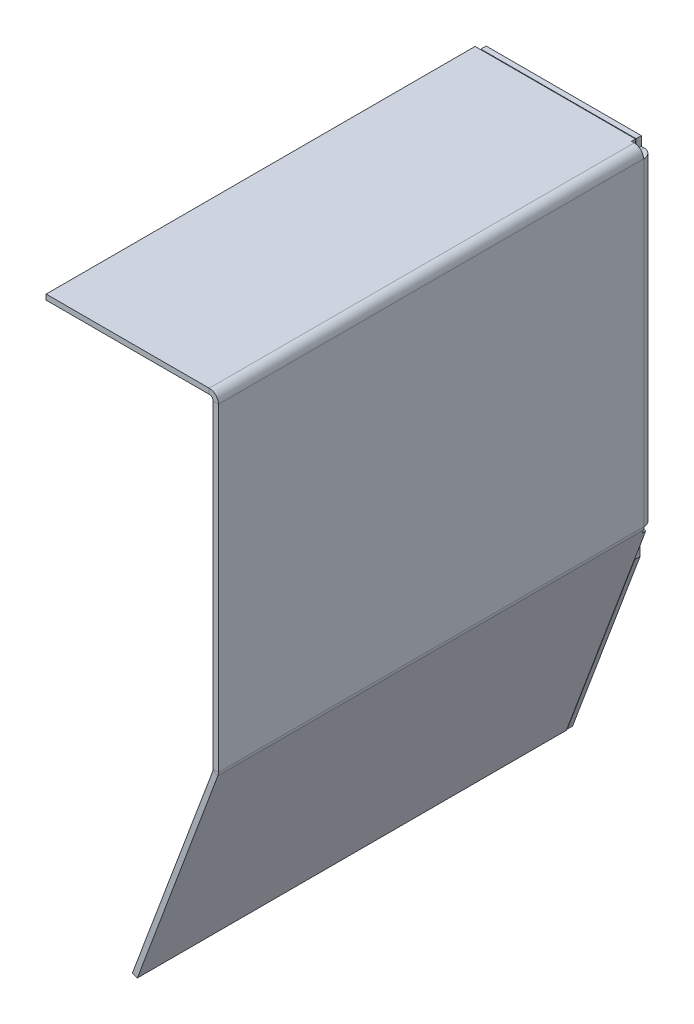
ISO-10303-21;
HEADER;
FILE_DESCRIPTION(('STEP AP214'),'2;1');
FILE_NAME('part.step','',(''),(''),'','','');
FILE_SCHEMA(('AUTOMOTIVE_DESIGN { 1 0 10303 214 1 1 1 1 }'));
ENDSEC;
DATA;
#1=APPLICATION_CONTEXT('core data for automotive mechanical design processes');
#2=APPLICATION_PROTOCOL_DEFINITION('international standard','automotive_design',2000,#1);
#3=PRODUCT_CONTEXT('',#1,'mechanical');
#4=PRODUCT('Part','Part','',(#3));
#5=PRODUCT_RELATED_PRODUCT_CATEGORY('part','',(#4));
#6=PRODUCT_DEFINITION_FORMATION('','',#4);
#7=PRODUCT_DEFINITION_CONTEXT('part definition',#1,'design');
#8=PRODUCT_DEFINITION('design','',#6,#7);
#9=PRODUCT_DEFINITION_SHAPE('','',#8);
#10=(LENGTH_UNIT() NAMED_UNIT(*) SI_UNIT(.MILLI.,.METRE.));
#11=(NAMED_UNIT(*) PLANE_ANGLE_UNIT() SI_UNIT($,.RADIAN.));
#12=(NAMED_UNIT(*) SI_UNIT($,.STERADIAN.) SOLID_ANGLE_UNIT());
#13=UNCERTAINTY_MEASURE_WITH_UNIT(LENGTH_MEASURE(1.E-05),#10,'distance_accuracy_value','');
#14=(GEOMETRIC_REPRESENTATION_CONTEXT(3) GLOBAL_UNCERTAINTY_ASSIGNED_CONTEXT((#13)) GLOBAL_UNIT_ASSIGNED_CONTEXT((#10,
#11,#12)) REPRESENTATION_CONTEXT('',''));
#15=CARTESIAN_POINT('',(0.,0.,0.));
#16=DIRECTION('',(0.,0.,1.));
#17=DIRECTION('',(1.,0.,0.));
#18=AXIS2_PLACEMENT_3D('',#15,#16,#17);
#19=CARTESIAN_POINT('',(0.,0.,164.));
#20=DIRECTION('',(-1.,0.,0.));
#21=DIRECTION('',(0.,0.,1.));
#22=AXIS2_PLACEMENT_3D('',#19,#20,#21);
#23=PLANE('',#22);
#24=DIRECTION('',(0.,0.,-1.));
#25=VECTOR('',#24,1.);
#26=CARTESIAN_POINT('',(0.,120.5,3.7));
#27=LINE('',#26,#25);
#28=CARTESIAN_POINT('',(0.,120.5,3.7));
#29=VERTEX_POINT('',#28);
#30=CARTESIAN_POINT('',(0.,120.5,3.49999999999999));
#31=VERTEX_POINT('',#30);
#32=EDGE_CURVE('E660',#29,#31,#27,.T.);
#33=ORIENTED_EDGE('',*,*,#32,.T.);
#34=DIRECTION('',(0.,-1.,0.));
#35=VECTOR('',#34,1.);
#36=CARTESIAN_POINT('',(0.,0.271244186189901,3.49999999999999));
#37=LINE('',#36,#35);
#38=CARTESIAN_POINT('',(0.,0.271244186189901,3.49999999999999));
#39=VERTEX_POINT('',#38);
#40=EDGE_CURVE('E423',#39,#31,#37,.F.);
#41=ORIENTED_EDGE('',*,*,#40,.F.);
#42=DIRECTION('',(0.,0.,-1.));
#43=VECTOR('',#42,1.);
#44=CARTESIAN_POINT('',(0.,0.271244186189906,164.));
#45=LINE('',#44,#43);
#46=CARTESIAN_POINT('',(0.,0.271244186189906,164.));
#47=VERTEX_POINT('',#46);
#48=EDGE_CURVE('E247',#47,#39,#45,.T.);
#49=ORIENTED_EDGE('',*,*,#48,.F.);
#50=DIRECTION('',(0.,1.,0.));
#51=VECTOR('',#50,1.);
#52=CARTESIAN_POINT('',(0.,0.,164.));
#53=LINE('',#52,#51);
#54=CARTESIAN_POINT('',(0.,120.5,164.));
#55=VERTEX_POINT('',#54);
#56=EDGE_CURVE('E191',#47,#55,#53,.T.);
#57=ORIENTED_EDGE('',*,*,#56,.T.);
#58=DIRECTION('',(0.,0.,-1.));
#59=VECTOR('',#58,1.);
#60=CARTESIAN_POINT('',(0.,120.5,164.));
#61=LINE('',#60,#59);
#62=EDGE_CURVE('E251',#55,#29,#61,.T.);
#63=ORIENTED_EDGE('',*,*,#62,.T.);
#64=EDGE_LOOP('',(#33,#41,#49,#57,#63));
#65=FACE_BOUND('',#64,.T.);
#66=ADVANCED_FACE('F100',(#65),#23,.T.);
#67=CARTESIAN_POINT('',(2.,0.,164.));
#68=DIRECTION('',(-1.,0.,0.));
#69=DIRECTION('',(0.,0.,1.));
#70=AXIS2_PLACEMENT_3D('',#67,#68,#69);
#71=PLANE('',#70);
#72=DIRECTION('',(0.,-1.,0.));
#73=VECTOR('',#72,1.);
#74=CARTESIAN_POINT('',(2.00000000000002,0.271244186189901,3.5));
#75=LINE('',#74,#73);
#76=CARTESIAN_POINT('',(2.,0.271244186189904,3.5));
#77=VERTEX_POINT('',#76);
#78=CARTESIAN_POINT('',(2.,120.5,3.5));
#79=VERTEX_POINT('',#78);
#80=EDGE_CURVE('E539',#77,#79,#75,.F.);
#81=ORIENTED_EDGE('',*,*,#80,.T.);
#82=DIRECTION('',(0.,0.,-1.));
#83=VECTOR('',#82,1.);
#84=CARTESIAN_POINT('',(2.,120.5,3.7));
#85=LINE('',#84,#83);
#86=CARTESIAN_POINT('',(2.,120.5,3.7));
#87=VERTEX_POINT('',#86);
#88=EDGE_CURVE('E304',#87,#79,#85,.T.);
#89=ORIENTED_EDGE('',*,*,#88,.F.);
#90=DIRECTION('',(0.,0.,-1.));
#91=VECTOR('',#90,1.);
#92=CARTESIAN_POINT('',(2.,120.5,164.));
#93=LINE('',#92,#91);
#94=CARTESIAN_POINT('',(2.,120.5,164.));
#95=VERTEX_POINT('',#94);
#96=EDGE_CURVE('E217',#95,#87,#93,.T.);
#97=ORIENTED_EDGE('',*,*,#96,.F.);
#98=DIRECTION('',(0.,1.,0.));
#99=VECTOR('',#98,1.);
#100=CARTESIAN_POINT('',(2.,0.,164.));
#101=LINE('',#100,#99);
#102=CARTESIAN_POINT('',(2.,0.271244186189906,164.));
#103=VERTEX_POINT('',#102);
#104=EDGE_CURVE('E188',#103,#95,#101,.T.);
#105=ORIENTED_EDGE('',*,*,#104,.F.);
#106=DIRECTION('',(0.,0.,-1.));
#107=VECTOR('',#106,1.);
#108=CARTESIAN_POINT('',(2.,0.271244186189906,164.));
#109=LINE('',#108,#107);
#110=EDGE_CURVE('E208',#103,#77,#109,.T.);
#111=ORIENTED_EDGE('',*,*,#110,.T.);
#112=EDGE_LOOP('',(#81,#89,#97,#105,#111));
#113=FACE_BOUND('',#112,.T.);
#114=ADVANCED_FACE('F219',(#113),#71,.F.);
#115=CARTESIAN_POINT('',(2.,120.5,3.7));
#116=DIRECTION('',(0.,-1.,0.));
#117=DIRECTION('',(1.,0.,0.));
#118=AXIS2_PLACEMENT_3D('',#115,#116,#117);
#119=PLANE('',#118);
#120=DIRECTION('',(1.,0.,0.));
#121=VECTOR('',#120,1.);
#122=CARTESIAN_POINT('',(0.,120.5,3.49999999999999));
#123=LINE('',#122,#121);
#124=EDGE_CURVE('E537',#31,#79,#123,.T.);
#125=ORIENTED_EDGE('',*,*,#124,.F.);
#126=ORIENTED_EDGE('',*,*,#32,.F.);
#127=DIRECTION('',(-1.,0.,0.));
#128=VECTOR('',#127,1.);
#129=CARTESIAN_POINT('',(2.,120.5,3.7));
#130=LINE('',#129,#128);
#131=EDGE_CURVE('E395',#87,#29,#130,.T.);
#132=ORIENTED_EDGE('',*,*,#131,.F.);
#133=ORIENTED_EDGE('',*,*,#88,.T.);
#134=EDGE_LOOP('',(#125,#126,#132,#133));
#135=FACE_BOUND('',#134,.T.);
#136=ADVANCED_FACE('F665',(#135),#119,.F.);
#137=CARTESIAN_POINT('',(-1.49999999999999,0.271244186189906,164.));
#138=DIRECTION('',(0.,0.,-1.));
#139=DIRECTION('',(-1.,0.,0.));
#140=AXIS2_PLACEMENT_3D('',#137,#138,#139);
#141=CYLINDRICAL_SURFACE('',#140,1.5);
#142=ORIENTED_EDGE('',*,*,#48,.T.);
#143=CARTESIAN_POINT('',(-1.49999999999999,0.271244186189906,3.5));
#144=DIRECTION('',(0.,0.,1.));
#145=DIRECTION('',(-1.,0.,0.));
#146=AXIS2_PLACEMENT_3D('',#143,#144,#145);
#147=CIRCLE('',#146,1.5);
#148=CARTESIAN_POINT('',(-0.0949917161273905,-0.2540668856993,3.5));
#149=VERTEX_POINT('',#148);
#150=EDGE_CURVE('E428',#149,#39,#147,.T.);
#151=ORIENTED_EDGE('',*,*,#150,.F.);
#152=DIRECTION('',(0.,0.,-1.));
#153=VECTOR('',#152,1.);
#154=CARTESIAN_POINT('',(-0.0949917161273857,-0.254066885699303,164.));
#155=LINE('',#154,#153);
#156=CARTESIAN_POINT('',(-0.0949917161273857,-0.254066885699303,164.));
#157=VERTEX_POINT('',#156);
#158=EDGE_CURVE('E243',#157,#149,#155,.T.);
#159=ORIENTED_EDGE('',*,*,#158,.F.);
#160=CARTESIAN_POINT('',(-1.49999999999999,0.271244186189906,164.));
#161=DIRECTION('',(0.,0.,-1.));
#162=DIRECTION('',(-1.,0.,0.));
#163=AXIS2_PLACEMENT_3D('',#160,#161,#162);
#164=CIRCLE('',#163,1.5);
#165=EDGE_CURVE('E316',#157,#47,#164,.F.);
#166=ORIENTED_EDGE('',*,*,#165,.T.);
#167=EDGE_LOOP('',(#142,#151,#159,#166));
#168=FACE_BOUND('',#167,.T.);
#169=ADVANCED_FACE('F427',(#168),#141,.F.);
#170=CARTESIAN_POINT('',(-1.49999999999999,0.271244186189906,164.));
#171=DIRECTION('',(0.,0.,-1.));
#172=DIRECTION('',(-1.,0.,0.));
#173=AXIS2_PLACEMENT_3D('',#170,#171,#172);
#174=CYLINDRICAL_SURFACE('',#173,3.5);
#175=CARTESIAN_POINT('',(-1.49999999999999,0.271244186189906,3.5));
#176=DIRECTION('',(0.,0.,-1.));
#177=DIRECTION('',(-1.,0.,0.));
#178=AXIS2_PLACEMENT_3D('',#175,#176,#177);
#179=CIRCLE('',#178,3.5);
#180=CARTESIAN_POINT('',(1.7783526623694,-0.954481648218239,3.5));
#181=VERTEX_POINT('',#180);
#182=EDGE_CURVE('E212',#77,#181,#179,.T.);
#183=ORIENTED_EDGE('',*,*,#182,.F.);
#184=ORIENTED_EDGE('',*,*,#110,.F.);
#185=CARTESIAN_POINT('',(-1.49999999999999,0.271244186189906,164.));
#186=DIRECTION('',(0.,0.,1.));
#187=DIRECTION('',(1.,0.,0.));
#188=AXIS2_PLACEMENT_3D('',#185,#186,#187);
#189=CIRCLE('',#188,3.5);
#190=CARTESIAN_POINT('',(1.7783526623694,-0.954481648218242,164.));
#191=VERTEX_POINT('',#190);
#192=EDGE_CURVE('E197',#191,#103,#189,.T.);
#193=ORIENTED_EDGE('',*,*,#192,.F.);
#194=DIRECTION('',(0.,0.,-1.));
#195=VECTOR('',#194,1.);
#196=CARTESIAN_POINT('',(1.7783526623694,-0.954481648218242,164.));
#197=LINE('',#196,#195);
#198=EDGE_CURVE('E216',#191,#181,#197,.T.);
#199=ORIENTED_EDGE('',*,*,#198,.T.);
#200=EDGE_LOOP('',(#183,#184,#193,#199));
#201=FACE_BOUND('',#200,.T.);
#202=ADVANCED_FACE('F209',(#201),#174,.T.);
#203=CARTESIAN_POINT('',(-1.5,120.5,164.));
#204=DIRECTION('',(0.,0.,-1.));
#205=DIRECTION('',(-1.,0.,0.));
#206=AXIS2_PLACEMENT_3D('',#203,#204,#205);
#207=CYLINDRICAL_SURFACE('',#206,1.5);
#208=DIRECTION('',(0.,0.,-1.));
#209=VECTOR('',#208,1.);
#210=CARTESIAN_POINT('',(-1.5,122.,164.));
#211=LINE('',#210,#209);
#212=CARTESIAN_POINT('',(-1.5,122.,164.));
#213=VERTEX_POINT('',#212);
#214=CARTESIAN_POINT('',(-1.5,122.,3.7));
#215=VERTEX_POINT('',#214);
#216=EDGE_CURVE('E255',#213,#215,#211,.T.);
#217=ORIENTED_EDGE('',*,*,#216,.T.);
#218=CARTESIAN_POINT('',(-1.5,120.5,3.7));
#219=DIRECTION('',(0.,0.,1.));
#220=DIRECTION('',(-1.,0.,0.));
#221=AXIS2_PLACEMENT_3D('',#218,#219,#220);
#222=CIRCLE('',#221,1.5);
#223=EDGE_CURVE('E414',#29,#215,#222,.T.);
#224=ORIENTED_EDGE('',*,*,#223,.F.);
#225=ORIENTED_EDGE('',*,*,#62,.F.);
#226=CARTESIAN_POINT('',(-1.5,120.5,164.));
#227=DIRECTION('',(0.,0.,-1.));
#228=DIRECTION('',(-1.,0.,0.));
#229=AXIS2_PLACEMENT_3D('',#226,#227,#228);
#230=CIRCLE('',#229,1.5);
#231=EDGE_CURVE('E310',#55,#213,#230,.F.);
#232=ORIENTED_EDGE('',*,*,#231,.T.);
#233=EDGE_LOOP('',(#217,#224,#225,#232));
#234=FACE_BOUND('',#233,.T.);
#235=ADVANCED_FACE('F412',(#234),#207,.F.);
#236=CARTESIAN_POINT('',(-1.5,120.5,164.));
#237=DIRECTION('',(0.,0.,-1.));
#238=DIRECTION('',(-1.,0.,0.));
#239=AXIS2_PLACEMENT_3D('',#236,#237,#238);
#240=CYLINDRICAL_SURFACE('',#239,3.5);
#241=CARTESIAN_POINT('',(-1.5,120.5,3.7));
#242=DIRECTION('',(0.,0.,-1.));
#243=DIRECTION('',(-1.,0.,0.));
#244=AXIS2_PLACEMENT_3D('',#241,#242,#243);
#245=CIRCLE('',#244,3.50000000000001);
#246=CARTESIAN_POINT('',(-1.5,124.,3.7));
#247=VERTEX_POINT('',#246);
#248=EDGE_CURVE('E384',#247,#87,#245,.T.);
#249=ORIENTED_EDGE('',*,*,#248,.F.);
#250=DIRECTION('',(0.,0.,-1.));
#251=VECTOR('',#250,1.);
#252=CARTESIAN_POINT('',(-1.5,124.,164.));
#253=LINE('',#252,#251);
#254=CARTESIAN_POINT('',(-1.5,124.,164.));
#255=VERTEX_POINT('',#254);
#256=EDGE_CURVE('E227',#255,#247,#253,.T.);
#257=ORIENTED_EDGE('',*,*,#256,.F.);
#258=CARTESIAN_POINT('',(-1.5,120.5,164.));
#259=DIRECTION('',(0.,0.,1.));
#260=DIRECTION('',(1.,0.,0.));
#261=AXIS2_PLACEMENT_3D('',#258,#259,#260);
#262=CIRCLE('',#261,3.5);
#263=EDGE_CURVE('E224',#95,#255,#262,.T.);
#264=ORIENTED_EDGE('',*,*,#263,.F.);
#265=ORIENTED_EDGE('',*,*,#96,.T.);
#266=EDGE_LOOP('',(#249,#257,#264,#265));
#267=FACE_BOUND('',#266,.T.);
#268=ADVANCED_FACE('F393',(#267),#240,.T.);
#269=CARTESIAN_POINT('',(0.,0.271244186189906,164.));
#270=DIRECTION('',(0.,0.,1.));
#271=DIRECTION('',(1.,0.,0.));
#272=AXIS2_PLACEMENT_3D('',#269,#270,#271);
#273=PLANE('',#272);
#274=DIRECTION('',(1.,0.,0.));
#275=VECTOR('',#274,1.);
#276=CARTESIAN_POINT('',(0.,0.271244186189906,164.));
#277=LINE('',#276,#275);
#278=EDGE_CURVE('E14',#47,#103,#277,.T.);
#279=ORIENTED_EDGE('',*,*,#278,.F.);
#280=ORIENTED_EDGE('',*,*,#165,.F.);
#281=DIRECTION('',(-0.936672189248396,0.350207381259471,0.));
#282=VECTOR('',#281,1.);
#283=CARTESIAN_POINT('',(1.7783526623694,-0.954481648218242,164.));
#284=LINE('',#283,#282);
#285=EDGE_CURVE('E110',#191,#157,#284,.T.);
#286=ORIENTED_EDGE('',*,*,#285,.F.);
#287=ORIENTED_EDGE('',*,*,#192,.T.);
#288=EDGE_LOOP('',(#279,#280,#286,#287));
#289=FACE_BOUND('',#288,.T.);
#290=ADVANCED_FACE('F199',(#289),#273,.T.);
#291=CARTESIAN_POINT('',(1.7783526623694,-0.954481648218242,164.));
#292=DIRECTION('',(0.,0.,1.));
#293=DIRECTION('',(1.,0.,0.));
#294=AXIS2_PLACEMENT_3D('',#291,#292,#293);
#295=PLANE('',#294);
#296=ORIENTED_EDGE('',*,*,#56,.F.);
#297=ORIENTED_EDGE('',*,*,#278,.T.);
#298=ORIENTED_EDGE('',*,*,#104,.T.);
#299=DIRECTION('',(-1.,0.,0.));
#300=VECTOR('',#299,1.);
#301=CARTESIAN_POINT('',(2.,120.5,164.));
#302=LINE('',#301,#300);
#303=EDGE_CURVE('E267',#95,#55,#302,.T.);
#304=ORIENTED_EDGE('',*,*,#303,.T.);
#305=EDGE_LOOP('',(#296,#297,#298,#304));
#306=FACE_BOUND('',#305,.T.);
#307=ADVANCED_FACE('F186',(#306),#295,.T.);
#308=CARTESIAN_POINT('',(2.,0.271244186189906,2.2));
#309=DIRECTION('',(0.,0.,-1.));
#310=DIRECTION('',(-1.,0.,0.));
#311=AXIS2_PLACEMENT_3D('',#308,#309,#310);
#312=PLANE('',#311);
#313=DIRECTION('',(-0.936672189248397,0.350207381259468,0.));
#314=VECTOR('',#313,1.);
#315=CARTESIAN_POINT('',(1.32308306673209,-2.17215549424115,2.2));
#316=LINE('',#315,#314);
#317=CARTESIAN_POINT('',(1.32308306673209,-2.17215549424115,2.2));
#318=VERTEX_POINT('',#317);
#319=CARTESIAN_POINT('',(-0.550261311764701,-1.47174073172222,2.2));
#320=VERTEX_POINT('',#319);
#321=EDGE_CURVE('E622',#318,#320,#316,.T.);
#322=ORIENTED_EDGE('',*,*,#321,.F.);
#323=DIRECTION('',(0.350207381259468,0.936672189248397,0.));
#324=VECTOR('',#323,1.);
#325=CARTESIAN_POINT('',(2.20761089697956,0.193621652515151,2.2));
#326=LINE('',#325,#324);
#327=CARTESIAN_POINT('',(-28.5946977910769,-82.1908952271295,2.20000000000001));
#328=VERTEX_POINT('',#327);
#329=EDGE_CURVE('E104',#328,#318,#326,.T.);
#330=ORIENTED_EDGE('',*,*,#329,.F.);
#331=DIRECTION('',(-0.936672189248398,0.350207381259467,0.));
#332=VECTOR('',#331,1.);
#333=CARTESIAN_POINT('',(-28.8023086880564,-82.1132726934548,2.2));
#334=LINE('',#333,#332);
#335=CARTESIAN_POINT('',(-30.4680421695737,-81.4904804646106,2.20000000000001));
#336=VERTEX_POINT('',#335);
#337=EDGE_CURVE('E288',#328,#336,#334,.T.);
#338=ORIENTED_EDGE('',*,*,#337,.T.);
#339=DIRECTION('',(0.350207381259468,0.936672189248397,0.));
#340=VECTOR('',#339,1.);
#341=CARTESIAN_POINT('',(0.334266518482762,0.894036415034088,2.2));
#342=LINE('',#341,#340);
#343=EDGE_CURVE('E285',#336,#320,#342,.T.);
#344=ORIENTED_EDGE('',*,*,#343,.T.);
#345=EDGE_LOOP('',(#322,#330,#338,#344));
#346=FACE_BOUND('',#345,.T.);
#347=ADVANCED_FACE('F102',(#346),#312,.T.);
#348=CARTESIAN_POINT('',(-1.5,122.,164.));
#349=DIRECTION('',(0.,0.,1.));
#350=DIRECTION('',(1.,0.,0.));
#351=AXIS2_PLACEMENT_3D('',#348,#349,#350);
#352=PLANE('',#351);
#353=DIRECTION('',(0.,1.,0.));
#354=VECTOR('',#353,1.);
#355=CARTESIAN_POINT('',(-1.5,122.,164.));
#356=LINE('',#355,#354);
#357=EDGE_CURVE('E127',#213,#255,#356,.T.);
#358=ORIENTED_EDGE('',*,*,#357,.F.);
#359=ORIENTED_EDGE('',*,*,#231,.F.);
#360=ORIENTED_EDGE('',*,*,#303,.F.);
#361=ORIENTED_EDGE('',*,*,#263,.T.);
#362=EDGE_LOOP('',(#358,#359,#360,#361));
#363=FACE_BOUND('',#362,.T.);
#364=ADVANCED_FACE('F417',(#363),#352,.T.);
#365=CARTESIAN_POINT('',(2.,120.5,164.));
#366=DIRECTION('',(0.,0.,1.));
#367=DIRECTION('',(1.,0.,0.));
#368=AXIS2_PLACEMENT_3D('',#365,#366,#367);
#369=PLANE('',#368);
#370=DIRECTION('',(-1.,0.,0.));
#371=VECTOR('',#370,1.);
#372=CARTESIAN_POINT('',(0.,122.,164.));
#373=LINE('',#372,#371);
#374=CARTESIAN_POINT('',(-63.,122.,164.));
#375=VERTEX_POINT('',#374);
#376=EDGE_CURVE('E301',#213,#375,#373,.T.);
#377=ORIENTED_EDGE('',*,*,#376,.F.);
#378=ORIENTED_EDGE('',*,*,#357,.T.);
#379=DIRECTION('',(-1.,0.,0.));
#380=VECTOR('',#379,1.);
#381=CARTESIAN_POINT('',(0.,124.,164.));
#382=LINE('',#381,#380);
#383=CARTESIAN_POINT('',(-63.,124.,164.));
#384=VERTEX_POINT('',#383);
#385=EDGE_CURVE('E156',#255,#384,#382,.T.);
#386=ORIENTED_EDGE('',*,*,#385,.T.);
#387=DIRECTION('',(0.,1.,0.));
#388=VECTOR('',#387,1.);
#389=CARTESIAN_POINT('',(-63.,122.,164.));
#390=LINE('',#389,#388);
#391=EDGE_CURVE('E297',#375,#384,#390,.T.);
#392=ORIENTED_EDGE('',*,*,#391,.F.);
#393=EDGE_LOOP('',(#377,#378,#386,#392));
#394=FACE_BOUND('',#393,.T.);
#395=ADVANCED_FACE('F403',(#394),#369,.T.);
#396=CARTESIAN_POINT('',(0.,124.,164.));
#397=DIRECTION('',(0.,-1.,0.));
#398=DIRECTION('',(1.,0.,0.));
#399=AXIS2_PLACEMENT_3D('',#396,#397,#398);
#400=PLANE('',#399);
#401=DIRECTION('',(1.,0.,0.));
#402=VECTOR('',#401,1.);
#403=CARTESIAN_POINT('',(-1.5,124.,3.7));
#404=LINE('',#403,#402);
#405=CARTESIAN_POINT('',(-2.5,124.,3.7));
#406=VERTEX_POINT('',#405);
#407=EDGE_CURVE('E380',#406,#247,#404,.T.);
#408=ORIENTED_EDGE('',*,*,#407,.F.);
#409=DIRECTION('',(0.,0.,-1.));
#410=VECTOR('',#409,1.);
#411=CARTESIAN_POINT('',(-2.5,124.,3.7));
#412=LINE('',#411,#410);
#413=CARTESIAN_POINT('',(-2.5,124.,2.2));
#414=VERTEX_POINT('',#413);
#415=EDGE_CURVE('E278',#406,#414,#412,.T.);
#416=ORIENTED_EDGE('',*,*,#415,.T.);
#417=DIRECTION('',(-1.,0.,0.));
#418=VECTOR('',#417,1.);
#419=CARTESIAN_POINT('',(-1.5,124.,2.2));
#420=LINE('',#419,#418);
#421=CARTESIAN_POINT('',(-63.,124.,2.20000000000001));
#422=VERTEX_POINT('',#421);
#423=EDGE_CURVE('E274',#414,#422,#420,.T.);
#424=ORIENTED_EDGE('',*,*,#423,.T.);
#425=DIRECTION('',(0.,0.,-1.));
#426=VECTOR('',#425,1.);
#427=CARTESIAN_POINT('',(-63.,124.,164.));
#428=LINE('',#427,#426);
#429=EDGE_CURVE('E263',#384,#422,#428,.T.);
#430=ORIENTED_EDGE('',*,*,#429,.F.);
#431=ORIENTED_EDGE('',*,*,#385,.F.);
#432=ORIENTED_EDGE('',*,*,#256,.T.);
#433=EDGE_LOOP('',(#408,#416,#424,#430,#431,#432));
#434=FACE_BOUND('',#433,.T.);
#435=ADVANCED_FACE('F398',(#434),#400,.F.);
#436=CARTESIAN_POINT('',(-63.,122.,164.));
#437=DIRECTION('',(-1.,0.,0.));
#438=DIRECTION('',(0.,0.,1.));
#439=AXIS2_PLACEMENT_3D('',#436,#437,#438);
#440=PLANE('',#439);
#441=DIRECTION('',(0.,1.,0.));
#442=VECTOR('',#441,1.);
#443=CARTESIAN_POINT('',(-63.,120.5,2.2));
#444=LINE('',#443,#442);
#445=CARTESIAN_POINT('',(-63.,122.,2.20000000000001));
#446=VERTEX_POINT('',#445);
#447=EDGE_CURVE('E277',#446,#422,#444,.T.);
#448=ORIENTED_EDGE('',*,*,#447,.F.);
#449=DIRECTION('',(0.,0.,-1.));
#450=VECTOR('',#449,1.);
#451=CARTESIAN_POINT('',(-63.,122.,164.));
#452=LINE('',#451,#450);
#453=EDGE_CURVE('E259',#375,#446,#452,.T.);
#454=ORIENTED_EDGE('',*,*,#453,.F.);
#455=ORIENTED_EDGE('',*,*,#391,.T.);
#456=ORIENTED_EDGE('',*,*,#429,.T.);
#457=EDGE_LOOP('',(#448,#454,#455,#456));
#458=FACE_BOUND('',#457,.T.);
#459=ADVANCED_FACE('F402',(#458),#440,.T.);
#460=CARTESIAN_POINT('',(0.,122.,164.));
#461=DIRECTION('',(0.,-1.,0.));
#462=DIRECTION('',(1.,0.,0.));
#463=AXIS2_PLACEMENT_3D('',#460,#461,#462);
#464=PLANE('',#463);
#465=DIRECTION('',(0.,0.,-1.));
#466=VECTOR('',#465,1.);
#467=CARTESIAN_POINT('',(-2.5,122.,3.7));
#468=LINE('',#467,#466);
#469=CARTESIAN_POINT('',(-2.5,122.,3.7));
#470=VERTEX_POINT('',#469);
#471=CARTESIAN_POINT('',(-2.5,122.,2.2));
#472=VERTEX_POINT('',#471);
#473=EDGE_CURVE('E118',#470,#472,#468,.T.);
#474=ORIENTED_EDGE('',*,*,#473,.F.);
#475=DIRECTION('',(-1.,0.,0.));
#476=VECTOR('',#475,1.);
#477=CARTESIAN_POINT('',(-2.5,122.,3.7));
#478=LINE('',#477,#476);
#479=EDGE_CURVE('E409',#215,#470,#478,.T.);
#480=ORIENTED_EDGE('',*,*,#479,.F.);
#481=ORIENTED_EDGE('',*,*,#216,.F.);
#482=ORIENTED_EDGE('',*,*,#376,.T.);
#483=ORIENTED_EDGE('',*,*,#453,.T.);
#484=DIRECTION('',(-1.,0.,0.));
#485=VECTOR('',#484,1.);
#486=CARTESIAN_POINT('',(-1.5,122.,2.2));
#487=LINE('',#486,#485);
#488=EDGE_CURVE('E282',#472,#446,#487,.T.);
#489=ORIENTED_EDGE('',*,*,#488,.F.);
#490=EDGE_LOOP('',(#474,#480,#481,#482,#483,#489));
#491=FACE_BOUND('',#490,.T.);
#492=ADVANCED_FACE('F406',(#491),#464,.T.);
#493=CARTESIAN_POINT('',(-30.4680421695737,-81.4904804646106,164.));
#494=DIRECTION('',(-0.936672189248397,0.350207381259468,0.));
#495=DIRECTION('',(-0.350207381259468,-0.936672189248397,0.));
#496=AXIS2_PLACEMENT_3D('',#493,#494,#495);
#497=PLANE('',#496);
#498=DIRECTION('',(0.,0.,-1.));
#499=VECTOR('',#498,1.);
#500=CARTESIAN_POINT('',(-0.550261311764701,-1.47174073172222,3.5));
#501=LINE('',#500,#499);
#502=CARTESIAN_POINT('',(-0.550261311764701,-1.47174073172222,3.5));
#503=VERTEX_POINT('',#502);
#504=EDGE_CURVE('E641',#503,#320,#501,.T.);
#505=ORIENTED_EDGE('',*,*,#504,.T.);
#506=ORIENTED_EDGE('',*,*,#343,.F.);
#507=DIRECTION('',(0.,0.,-1.));
#508=VECTOR('',#507,1.);
#509=CARTESIAN_POINT('',(-30.4680421695737,-81.4904804646106,164.));
#510=LINE('',#509,#508);
#511=CARTESIAN_POINT('',(-30.4680421695737,-81.4904804646106,164.));
#512=VERTEX_POINT('',#511);
#513=EDGE_CURVE('E240',#512,#336,#510,.T.);
#514=ORIENTED_EDGE('',*,*,#513,.F.);
#515=DIRECTION('',(0.350207381259468,0.936672189248397,0.));
#516=VECTOR('',#515,1.);
#517=CARTESIAN_POINT('',(-30.4680421695737,-81.4904804646106,164.));
#518=LINE('',#517,#516);
#519=EDGE_CURVE('E319',#512,#157,#518,.T.);
#520=ORIENTED_EDGE('',*,*,#519,.T.);
#521=ORIENTED_EDGE('',*,*,#158,.T.);
#522=DIRECTION('',(0.350207381259468,0.936672189248397,0.));
#523=VECTOR('',#522,1.);
#524=CARTESIAN_POINT('',(-0.550261311764701,-1.47174073172222,3.5));
#525=LINE('',#524,#523);
#526=EDGE_CURVE('E633',#503,#149,#525,.T.);
#527=ORIENTED_EDGE('',*,*,#526,.F.);
#528=EDGE_LOOP('',(#505,#506,#514,#520,#521,#527));
#529=FACE_BOUND('',#528,.T.);
#530=ADVANCED_FACE('F669',(#529),#497,.T.);
#531=CARTESIAN_POINT('',(-28.5946977910769,-82.1908952271295,164.));
#532=DIRECTION('',(-0.350207381259467,-0.936672189248398,0.));
#533=DIRECTION('',(0.936672189248398,-0.350207381259467,0.));
#534=AXIS2_PLACEMENT_3D('',#531,#532,#533);
#535=PLANE('',#534);
#536=ORIENTED_EDGE('',*,*,#337,.F.);
#537=DIRECTION('',(0.,0.,-1.));
#538=VECTOR('',#537,1.);
#539=CARTESIAN_POINT('',(-28.5946977910769,-82.1908952271295,164.));
#540=LINE('',#539,#538);
#541=CARTESIAN_POINT('',(-28.5946977910769,-82.1908952271295,164.));
#542=VERTEX_POINT('',#541);
#543=EDGE_CURVE('E150',#542,#328,#540,.T.);
#544=ORIENTED_EDGE('',*,*,#543,.F.);
#545=DIRECTION('',(-0.936672189248398,0.350207381259467,0.));
#546=VECTOR('',#545,1.);
#547=CARTESIAN_POINT('',(-28.5946977910769,-82.1908952271295,164.));
#548=LINE('',#547,#546);
#549=EDGE_CURVE('E323',#542,#512,#548,.T.);
#550=ORIENTED_EDGE('',*,*,#549,.T.);
#551=ORIENTED_EDGE('',*,*,#513,.T.);
#552=EDGE_LOOP('',(#536,#544,#550,#551));
#553=FACE_BOUND('',#552,.T.);
#554=ADVANCED_FACE('F672',(#553),#535,.T.);
#555=CARTESIAN_POINT('',(-28.5946977910769,-82.1908952271295,164.));
#556=DIRECTION('',(-0.936672189248397,0.350207381259468,0.));
#557=DIRECTION('',(-0.350207381259468,-0.936672189248397,0.));
#558=AXIS2_PLACEMENT_3D('',#555,#556,#557);
#559=PLANE('',#558);
#560=ORIENTED_EDGE('',*,*,#329,.T.);
#561=DIRECTION('',(0.,0.,-1.));
#562=VECTOR('',#561,1.);
#563=CARTESIAN_POINT('',(1.32308306673209,-2.17215549424115,3.5));
#564=LINE('',#563,#562);
#565=CARTESIAN_POINT('',(1.32308306673209,-2.17215549424115,3.5));
#566=VERTEX_POINT('',#565);
#567=EDGE_CURVE('E638',#566,#318,#564,.T.);
#568=ORIENTED_EDGE('',*,*,#567,.F.);
#569=DIRECTION('',(-0.350207381259471,-0.936672189248397,0.));
#570=VECTOR('',#569,1.);
#571=CARTESIAN_POINT('',(1.32308306673209,-2.17215549424115,3.5));
#572=LINE('',#571,#570);
#573=EDGE_CURVE('E337',#181,#566,#572,.T.);
#574=ORIENTED_EDGE('',*,*,#573,.F.);
#575=ORIENTED_EDGE('',*,*,#198,.F.);
#576=DIRECTION('',(0.350207381259468,0.936672189248397,0.));
#577=VECTOR('',#576,1.);
#578=CARTESIAN_POINT('',(-28.5946977910769,-82.1908952271295,164.));
#579=LINE('',#578,#577);
#580=EDGE_CURVE('E204',#542,#191,#579,.T.);
#581=ORIENTED_EDGE('',*,*,#580,.F.);
#582=ORIENTED_EDGE('',*,*,#543,.T.);
#583=EDGE_LOOP('',(#560,#568,#574,#575,#581,#582));
#584=FACE_BOUND('',#583,.T.);
#585=ADVANCED_FACE('F334',(#584),#559,.F.);
#586=CARTESIAN_POINT('',(-1.5,120.5,164.));
#587=DIRECTION('',(0.,0.,-1.));
#588=DIRECTION('',(-1.,0.,0.));
#589=AXIS2_PLACEMENT_3D('',#586,#587,#588);
#590=PLANE('',#589);
#591=ORIENTED_EDGE('',*,*,#580,.T.);
#592=ORIENTED_EDGE('',*,*,#285,.T.);
#593=ORIENTED_EDGE('',*,*,#519,.F.);
#594=ORIENTED_EDGE('',*,*,#549,.F.);
#595=EDGE_LOOP('',(#591,#592,#593,#594));
#596=FACE_BOUND('',#595,.T.);
#597=ADVANCED_FACE('F330',(#596),#590,.F.);
#598=CARTESIAN_POINT('',(-1.5,120.5,2.2));
#599=DIRECTION('',(0.,0.,-1.));
#600=DIRECTION('',(-1.,0.,0.));
#601=AXIS2_PLACEMENT_3D('',#598,#599,#600);
#602=PLANE('',#601);
#603=DIRECTION('',(0.,1.,0.));
#604=VECTOR('',#603,1.);
#605=CARTESIAN_POINT('',(-2.5,124.,2.2));
#606=LINE('',#605,#604);
#607=EDGE_CURVE('E396',#472,#414,#606,.T.);
#608=ORIENTED_EDGE('',*,*,#607,.F.);
#609=ORIENTED_EDGE('',*,*,#488,.T.);
#610=ORIENTED_EDGE('',*,*,#447,.T.);
#611=ORIENTED_EDGE('',*,*,#423,.F.);
#612=EDGE_LOOP('',(#608,#609,#610,#611));
#613=FACE_BOUND('',#612,.T.);
#614=ADVANCED_FACE('F709',(#613),#602,.T.);
#615=CARTESIAN_POINT('',(-2.5,124.,3.7));
#616=DIRECTION('',(-1.,0.,0.));
#617=DIRECTION('',(0.,-1.,0.));
#618=AXIS2_PLACEMENT_3D('',#615,#616,#617);
#619=PLANE('',#618);
#620=ORIENTED_EDGE('',*,*,#607,.T.);
#621=ORIENTED_EDGE('',*,*,#415,.F.);
#622=DIRECTION('',(0.,1.,0.));
#623=VECTOR('',#622,1.);
#624=CARTESIAN_POINT('',(-2.5,124.,3.7));
#625=LINE('',#624,#623);
#626=EDGE_CURVE('E386',#470,#406,#625,.T.);
#627=ORIENTED_EDGE('',*,*,#626,.F.);
#628=ORIENTED_EDGE('',*,*,#473,.T.);
#629=EDGE_LOOP('',(#620,#621,#627,#628));
#630=FACE_BOUND('',#629,.T.);
#631=ADVANCED_FACE('F683',(#630),#619,.F.);
#632=CARTESIAN_POINT('',(-1.5,120.5,3.7));
#633=DIRECTION('',(0.,0.,-1.));
#634=DIRECTION('',(-1.,0.,0.));
#635=AXIS2_PLACEMENT_3D('',#632,#633,#634);
#636=PLANE('',#635);
#637=ORIENTED_EDGE('',*,*,#248,.T.);
#638=ORIENTED_EDGE('',*,*,#131,.T.);
#639=ORIENTED_EDGE('',*,*,#223,.T.);
#640=ORIENTED_EDGE('',*,*,#479,.T.);
#641=ORIENTED_EDGE('',*,*,#626,.T.);
#642=ORIENTED_EDGE('',*,*,#407,.T.);
#643=EDGE_LOOP('',(#637,#638,#639,#640,#641,#642));
#644=FACE_BOUND('',#643,.T.);
#645=ADVANCED_FACE('F382',(#644),#636,.T.);
#646=CARTESIAN_POINT('',(1.32308306673209,-2.17215549424115,3.5));
#647=DIRECTION('',(-0.350207381259468,-0.936672189248397,0.));
#648=DIRECTION('',(0.936672189248397,-0.350207381259468,0.));
#649=AXIS2_PLACEMENT_3D('',#646,#647,#648);
#650=PLANE('',#649);
#651=ORIENTED_EDGE('',*,*,#321,.T.);
#652=ORIENTED_EDGE('',*,*,#504,.F.);
#653=DIRECTION('',(-0.936672189248397,0.350207381259468,0.));
#654=VECTOR('',#653,1.);
#655=CARTESIAN_POINT('',(1.32308306673209,-2.17215549424115,3.5));
#656=LINE('',#655,#654);
#657=EDGE_CURVE('E629',#566,#503,#656,.T.);
#658=ORIENTED_EDGE('',*,*,#657,.F.);
#659=ORIENTED_EDGE('',*,*,#567,.T.);
#660=EDGE_LOOP('',(#651,#652,#658,#659));
#661=FACE_BOUND('',#660,.T.);
#662=ADVANCED_FACE('F675',(#661),#650,.F.);
#663=CARTESIAN_POINT('',(-1.49999999999999,0.271244186189906,3.5));
#664=DIRECTION('',(0.,0.,-1.));
#665=DIRECTION('',(-1.,0.,0.));
#666=AXIS2_PLACEMENT_3D('',#663,#664,#665);
#667=PLANE('',#666);
#668=ORIENTED_EDGE('',*,*,#150,.T.);
#669=DIRECTION('',(1.,0.,0.));
#670=VECTOR('',#669,1.);
#671=CARTESIAN_POINT('',(0.,0.271244186189901,3.49999999999999));
#672=LINE('',#671,#670);
#673=EDGE_CURVE('E434',#39,#77,#672,.T.);
#674=ORIENTED_EDGE('',*,*,#673,.T.);
#675=ORIENTED_EDGE('',*,*,#182,.T.);
#676=ORIENTED_EDGE('',*,*,#573,.T.);
#677=ORIENTED_EDGE('',*,*,#657,.T.);
#678=ORIENTED_EDGE('',*,*,#526,.T.);
#679=EDGE_LOOP('',(#668,#674,#675,#676,#677,#678));
#680=FACE_BOUND('',#679,.T.);
#681=ADVANCED_FACE('F666',(#680),#667,.T.);
#682=CARTESIAN_POINT('',(-1.5,120.5,3.49999999999999));
#683=DIRECTION('',(0.,1.,0.));
#684=DIRECTION('',(-1.,0.,0.));
#685=AXIS2_PLACEMENT_3D('',#682,#683,#684);
#686=PLANE('',#685);
#687=DIRECTION('',(0.,0.,-1.));
#688=VECTOR('',#687,1.);
#689=CARTESIAN_POINT('',(-1.49999999999999,120.5,0.));
#690=LINE('',#689,#688);
#691=CARTESIAN_POINT('',(-1.49999999999999,120.5,1.99999999999999));
#692=VERTEX_POINT('',#691);
#693=CARTESIAN_POINT('',(-1.49999999999999,120.5,0.));
#694=VERTEX_POINT('',#693);
#695=EDGE_CURVE('E447',#692,#694,#690,.T.);
#696=ORIENTED_EDGE('',*,*,#695,.F.);
#697=CARTESIAN_POINT('',(-1.5,120.5,3.49999999999999));
#698=DIRECTION('',(0.,-1.,0.));
#699=DIRECTION('',(1.,0.,0.));
#700=AXIS2_PLACEMENT_3D('',#697,#698,#699);
#701=CIRCLE('',#700,1.5);
#702=EDGE_CURVE('E612',#31,#692,#701,.F.);
#703=ORIENTED_EDGE('',*,*,#702,.F.);
#704=ORIENTED_EDGE('',*,*,#124,.T.);
#705=CARTESIAN_POINT('',(-1.5,120.5,3.49999999999999));
#706=DIRECTION('',(0.,-1.,0.));
#707=DIRECTION('',(1.,0.,0.));
#708=AXIS2_PLACEMENT_3D('',#705,#706,#707);
#709=CIRCLE('',#708,3.5);
#710=EDGE_CURVE('E525',#79,#694,#709,.F.);
#711=ORIENTED_EDGE('',*,*,#710,.T.);
#712=EDGE_LOOP('',(#696,#703,#704,#711));
#713=FACE_BOUND('',#712,.T.);
#714=ADVANCED_FACE('F535',(#713),#686,.T.);
#715=CARTESIAN_POINT('',(-1.49999999999998,0.271244186189901,3.49999999999999));
#716=DIRECTION('',(0.,1.,0.));
#717=DIRECTION('',(-1.,0.,0.));
#718=AXIS2_PLACEMENT_3D('',#715,#716,#717);
#719=PLANE('',#718);
#720=CARTESIAN_POINT('',(-1.49999999999998,0.271244186189901,3.49999999999999));
#721=DIRECTION('',(0.,-1.,0.));
#722=DIRECTION('',(1.,0.,0.));
#723=AXIS2_PLACEMENT_3D('',#720,#721,#722);
#724=CIRCLE('',#723,1.5);
#725=CARTESIAN_POINT('',(-1.49999999999998,0.271244186189901,1.99999999999999));
#726=VERTEX_POINT('',#725);
#727=EDGE_CURVE('E617',#726,#39,#724,.T.);
#728=ORIENTED_EDGE('',*,*,#727,.F.);
#729=DIRECTION('',(0.,0.,-1.));
#730=VECTOR('',#729,1.);
#731=CARTESIAN_POINT('',(-1.49999999999999,0.271244186189901,1.99999999999999));
#732=LINE('',#731,#730);
#733=CARTESIAN_POINT('',(-1.49999999999999,0.271244186189902,0.));
#734=VERTEX_POINT('',#733);
#735=EDGE_CURVE('E533',#726,#734,#732,.T.);
#736=ORIENTED_EDGE('',*,*,#735,.T.);
#737=CARTESIAN_POINT('',(-1.49999999999998,0.271244186189901,3.49999999999999));
#738=DIRECTION('',(0.,-1.,0.));
#739=DIRECTION('',(1.,0.,0.));
#740=AXIS2_PLACEMENT_3D('',#737,#738,#739);
#741=CIRCLE('',#740,3.5);
#742=EDGE_CURVE('E526',#734,#77,#741,.T.);
#743=ORIENTED_EDGE('',*,*,#742,.T.);
#744=ORIENTED_EDGE('',*,*,#673,.F.);
#745=EDGE_LOOP('',(#728,#736,#743,#744));
#746=FACE_BOUND('',#745,.T.);
#747=ADVANCED_FACE('F787',(#746),#719,.F.);
#748=CARTESIAN_POINT('',(-1.49999999999998,0.271244186189901,3.49999999999999));
#749=DIRECTION('',(0.,-1.,0.));
#750=DIRECTION('',(0.,0.,-1.));
#751=AXIS2_PLACEMENT_3D('',#748,#749,#750);
#752=CYLINDRICAL_SURFACE('',#751,3.5);
#753=ORIENTED_EDGE('',*,*,#80,.F.);
#754=ORIENTED_EDGE('',*,*,#742,.F.);
#755=DIRECTION('',(0.,-1.,0.));
#756=VECTOR('',#755,1.);
#757=CARTESIAN_POINT('',(-1.49999999999999,120.5,0.));
#758=LINE('',#757,#756);
#759=EDGE_CURVE('E522',#734,#694,#758,.F.);
#760=ORIENTED_EDGE('',*,*,#759,.T.);
#761=ORIENTED_EDGE('',*,*,#710,.F.);
#762=EDGE_LOOP('',(#753,#754,#760,#761));
#763=FACE_BOUND('',#762,.T.);
#764=ADVANCED_FACE('F524',(#763),#752,.T.);
#765=CARTESIAN_POINT('',(-1.49999999999998,0.271244186189901,3.49999999999999));
#766=DIRECTION('',(0.,-1.,0.));
#767=DIRECTION('',(0.,0.,-1.));
#768=AXIS2_PLACEMENT_3D('',#765,#766,#767);
#769=CYLINDRICAL_SURFACE('',#768,1.5);
#770=ORIENTED_EDGE('',*,*,#40,.T.);
#771=ORIENTED_EDGE('',*,*,#702,.T.);
#772=DIRECTION('',(0.,-1.,0.));
#773=VECTOR('',#772,1.);
#774=CARTESIAN_POINT('',(-1.49999999999999,120.5,1.99999999999999));
#775=LINE('',#774,#773);
#776=EDGE_CURVE('E548',#692,#726,#775,.T.);
#777=ORIENTED_EDGE('',*,*,#776,.T.);
#778=ORIENTED_EDGE('',*,*,#727,.T.);
#779=EDGE_LOOP('',(#770,#771,#777,#778));
#780=FACE_BOUND('',#779,.T.);
#781=ADVANCED_FACE('F806',(#780),#769,.F.);
#782=CARTESIAN_POINT('',(0.,0.271244186189905,0.));
#783=DIRECTION('',(0.,-1.,0.));
#784=DIRECTION('',(1.,0.,0.));
#785=AXIS2_PLACEMENT_3D('',#782,#783,#784);
#786=PLANE('',#785);
#787=DIRECTION('',(-1.,0.,0.));
#788=VECTOR('',#787,1.);
#789=CARTESIAN_POINT('',(0.,0.271244186189905,0.));
#790=LINE('',#789,#788);
#791=CARTESIAN_POINT('',(-2.99999999999998,0.271244186189904,0.));
#792=VERTEX_POINT('',#791);
#793=EDGE_CURVE('E981',#792,#734,#790,.F.);
#794=ORIENTED_EDGE('',*,*,#793,.T.);
#795=ORIENTED_EDGE('',*,*,#735,.F.);
#796=DIRECTION('',(1.,0.,0.));
#797=VECTOR('',#796,1.);
#798=CARTESIAN_POINT('',(-83.055857558238,0.271244186189897,1.99999999999971));
#799=LINE('',#798,#797);
#800=CARTESIAN_POINT('',(-2.99999999999999,0.271244186189904,1.99999999999999));
#801=VERTEX_POINT('',#800);
#802=EDGE_CURVE('E556',#801,#726,#799,.T.);
#803=ORIENTED_EDGE('',*,*,#802,.F.);
#804=DIRECTION('',(0.,0.,-1.));
#805=VECTOR('',#804,1.);
#806=CARTESIAN_POINT('',(-2.99999999999998,0.271244186189904,0.));
#807=LINE('',#806,#805);
#808=EDGE_CURVE('E456',#792,#801,#807,.F.);
#809=ORIENTED_EDGE('',*,*,#808,.F.);
#810=EDGE_LOOP('',(#794,#795,#803,#809));
#811=FACE_BOUND('',#810,.T.);
#812=ADVANCED_FACE('F816',(#811),#786,.T.);
#813=CARTESIAN_POINT('',(-2.49999999999999,120.5,0.));
#814=DIRECTION('',(0.,1.,0.));
#815=DIRECTION('',(-1.,0.,0.));
#816=AXIS2_PLACEMENT_3D('',#813,#814,#815);
#817=PLANE('',#816);
#818=DIRECTION('',(-1.,0.,0.));
#819=VECTOR('',#818,1.);
#820=CARTESIAN_POINT('',(-83.0558575582391,120.499999999999,1.99999999999971));
#821=LINE('',#820,#819);
#822=CARTESIAN_POINT('',(-2.5,120.5,1.99999999999999));
#823=VERTEX_POINT('',#822);
#824=EDGE_CURVE('E532',#692,#823,#821,.T.);
#825=ORIENTED_EDGE('',*,*,#824,.F.);
#826=ORIENTED_EDGE('',*,*,#695,.T.);
#827=DIRECTION('',(1.,0.,0.));
#828=VECTOR('',#827,1.);
#829=CARTESIAN_POINT('',(-2.49999999999999,120.5,0.));
#830=LINE('',#829,#828);
#831=CARTESIAN_POINT('',(-2.49999999999999,120.5,0.));
#832=VERTEX_POINT('',#831);
#833=EDGE_CURVE('E545',#694,#832,#830,.F.);
#834=ORIENTED_EDGE('',*,*,#833,.T.);
#835=DIRECTION('',(0.,0.,-1.));
#836=VECTOR('',#835,1.);
#837=CARTESIAN_POINT('',(-2.49999999999999,120.5,0.));
#838=LINE('',#837,#836);
#839=EDGE_CURVE('E976',#832,#823,#838,.F.);
#840=ORIENTED_EDGE('',*,*,#839,.T.);
#841=EDGE_LOOP('',(#825,#826,#834,#840));
#842=FACE_BOUND('',#841,.T.);
#843=ADVANCED_FACE('F543',(#842),#817,.T.);
#844=CARTESIAN_POINT('',(-83.055857558238,17.6484417770314,-2.90051186194185E-13));
#845=DIRECTION('',(0.,0.,1.));
#846=DIRECTION('',(1.,0.,0.));
#847=AXIS2_PLACEMENT_3D('',#844,#845,#846);
#848=PLANE('',#847);
#849=ORIENTED_EDGE('',*,*,#759,.F.);
#850=ORIENTED_EDGE('',*,*,#793,.F.);
#851=DIRECTION('',(0.,-1.,0.));
#852=VECTOR('',#851,1.);
#853=CARTESIAN_POINT('',(-2.99999999999998,0.271244186189904,0.));
#854=LINE('',#853,#852);
#855=CARTESIAN_POINT('',(-2.99999999999998,-13.7347663845538,0.));
#856=VERTEX_POINT('',#855);
#857=EDGE_CURVE('E987',#856,#792,#854,.F.);
#858=ORIENTED_EDGE('',*,*,#857,.F.);
#859=DIRECTION('',(-0.350207381259468,-0.936672189248397,0.));
#860=VECTOR('',#859,1.);
#861=CARTESIAN_POINT('',(-2.99999999999998,-13.7347663845538,0.));
#862=LINE('',#861,#860);
#863=CARTESIAN_POINT('',(-28.4715732267351,-81.8615836209105,0.));
#864=VERTEX_POINT('',#863);
#865=EDGE_CURVE('E993',#864,#856,#862,.F.);
#866=ORIENTED_EDGE('',*,*,#865,.F.);
#867=DIRECTION('',(-0.98088784400635,0.194573989732892,0.));
#868=VECTOR('',#867,1.);
#869=CARTESIAN_POINT('',(-28.4715732267351,-81.8615836209105,0.));
#870=LINE('',#869,#868);
#871=CARTESIAN_POINT('',(-137.055857558238,-60.3222429574793,-4.78310144804742E-13));
#872=VERTEX_POINT('',#871);
#873=EDGE_CURVE('E997',#872,#864,#870,.F.);
#874=ORIENTED_EDGE('',*,*,#873,.F.);
#875=DIRECTION('',(0.,1.,0.));
#876=VECTOR('',#875,1.);
#877=CARTESIAN_POINT('',(-137.055857558238,-60.3222429574793,-4.78268683337668E-13));
#878=LINE('',#877,#876);
#879=CARTESIAN_POINT('',(-137.055857558238,-4.35155822296855,-4.78268683337668E-13));
#880=VERTEX_POINT('',#879);
#881=EDGE_CURVE('E1001',#880,#872,#878,.F.);
#882=ORIENTED_EDGE('',*,*,#881,.F.);
#883=DIRECTION('',(1.,0.,0.));
#884=VECTOR('',#883,1.);
#885=CARTESIAN_POINT('',(-137.055857558238,-4.35155822296855,-4.78268683337668E-13));
#886=LINE('',#885,#884);
#887=CARTESIAN_POINT('',(-83.055857558238,-4.35155822296855,-2.89889938617162E-13));
#888=VERTEX_POINT('',#887);
#889=EDGE_CURVE('E1005',#888,#880,#886,.F.);
#890=ORIENTED_EDGE('',*,*,#889,.F.);
#891=CARTESIAN_POINT('',(-83.055857558238,17.6484417770314,-2.90051186194185E-13));
#892=DIRECTION('',(0.,0.,1.));
#893=DIRECTION('',(1.,0.,0.));
#894=AXIS2_PLACEMENT_3D('',#891,#892,#893);
#895=CIRCLE('',#894,22.);
#896=CARTESIAN_POINT('',(-61.055857558238,17.6484417770314,-2.13264134560923E-13));
#897=VERTEX_POINT('',#896);
#898=EDGE_CURVE('E1009',#897,#888,#895,.F.);
#899=ORIENTED_EDGE('',*,*,#898,.F.);
#900=DIRECTION('',(0.,1.,0.));
#901=VECTOR('',#900,1.);
#902=CARTESIAN_POINT('',(-61.055857558238,17.6484417770314,-2.13289672382211E-13));
#903=LINE('',#902,#901);
#904=CARTESIAN_POINT('',(-61.055857558238,124.,-2.13289672382211E-13));
#905=VERTEX_POINT('',#904);
#906=EDGE_CURVE('E1013',#905,#897,#903,.F.);
#907=ORIENTED_EDGE('',*,*,#906,.F.);
#908=DIRECTION('',(1.,0.,0.));
#909=VECTOR('',#908,1.);
#910=CARTESIAN_POINT('',(-61.055857558238,124.,-2.13289672382211E-13));
#911=LINE('',#910,#909);
#912=CARTESIAN_POINT('',(-2.49999999999999,124.,0.));
#913=VERTEX_POINT('',#912);
#914=EDGE_CURVE('E560',#913,#905,#911,.F.);
#915=ORIENTED_EDGE('',*,*,#914,.F.);
#916=DIRECTION('',(0.,-1.,0.));
#917=VECTOR('',#916,1.);
#918=CARTESIAN_POINT('',(-2.49999999999999,120.5,0.));
#919=LINE('',#918,#917);
#920=EDGE_CURVE('E554',#832,#913,#919,.F.);
#921=ORIENTED_EDGE('',*,*,#920,.F.);
#922=ORIENTED_EDGE('',*,*,#833,.F.);
#923=EDGE_LOOP('',(#849,#850,#858,#866,#874,#882,#890,#899,#907,#915,#921,#922));
#924=FACE_BOUND('',#923,.T.);
#925=ADVANCED_FACE('F551',(#924),#848,.F.);
#926=CARTESIAN_POINT('',(-83.055857558238,17.6484417770314,1.99999999999971));
#927=DIRECTION('',(0.,0.,1.));
#928=DIRECTION('',(1.,0.,0.));
#929=AXIS2_PLACEMENT_3D('',#926,#927,#928);
#930=PLANE('',#929);
#931=ORIENTED_EDGE('',*,*,#802,.T.);
#932=ORIENTED_EDGE('',*,*,#776,.F.);
#933=ORIENTED_EDGE('',*,*,#824,.T.);
#934=DIRECTION('',(0.,1.,0.));
#935=VECTOR('',#934,1.);
#936=CARTESIAN_POINT('',(-2.49999999999999,17.6484417770315,1.99999999999999));
#937=LINE('',#936,#935);
#938=CARTESIAN_POINT('',(-2.5,124.,1.99999999999999));
#939=VERTEX_POINT('',#938);
#940=EDGE_CURVE('E598',#823,#939,#937,.T.);
#941=ORIENTED_EDGE('',*,*,#940,.T.);
#942=DIRECTION('',(-1.,0.,0.));
#943=VECTOR('',#942,1.);
#944=CARTESIAN_POINT('',(-83.055857558238,124.,1.99999999999971));
#945=LINE('',#944,#943);
#946=CARTESIAN_POINT('',(-61.055857558238,124.,1.99999999999979));
#947=VERTEX_POINT('',#946);
#948=EDGE_CURVE('E594',#939,#947,#945,.T.);
#949=ORIENTED_EDGE('',*,*,#948,.T.);
#950=DIRECTION('',(0.,-1.,0.));
#951=VECTOR('',#950,1.);
#952=CARTESIAN_POINT('',(-61.055857558238,17.6484417770314,1.99999999999979));
#953=LINE('',#952,#951);
#954=CARTESIAN_POINT('',(-61.055857558238,17.6484417770314,1.99999999999979));
#955=VERTEX_POINT('',#954);
#956=EDGE_CURVE('E590',#947,#955,#953,.T.);
#957=ORIENTED_EDGE('',*,*,#956,.T.);
#958=CARTESIAN_POINT('',(-83.055857558238,17.6484417770314,1.99999999999971));
#959=DIRECTION('',(0.,0.,1.));
#960=DIRECTION('',(1.,0.,0.));
#961=AXIS2_PLACEMENT_3D('',#958,#959,#960);
#962=CIRCLE('',#961,22.);
#963=CARTESIAN_POINT('',(-83.055857558238,-4.35155822296855,1.99999999999971));
#964=VERTEX_POINT('',#963);
#965=EDGE_CURVE('E586',#955,#964,#962,.F.);
#966=ORIENTED_EDGE('',*,*,#965,.T.);
#967=DIRECTION('',(-1.,0.,0.));
#968=VECTOR('',#967,1.);
#969=CARTESIAN_POINT('',(-83.055857558238,-4.35155822296855,1.99999999999971));
#970=LINE('',#969,#968);
#971=CARTESIAN_POINT('',(-137.055857558238,-4.35155822296855,1.99999999999952));
#972=VERTEX_POINT('',#971);
#973=EDGE_CURVE('E582',#964,#972,#970,.T.);
#974=ORIENTED_EDGE('',*,*,#973,.T.);
#975=DIRECTION('',(0.,-1.,0.));
#976=VECTOR('',#975,1.);
#977=CARTESIAN_POINT('',(-137.055857558238,17.6484417770314,1.99999999999952));
#978=LINE('',#977,#976);
#979=CARTESIAN_POINT('',(-137.055857558238,-60.3222429574793,1.99999999999952));
#980=VERTEX_POINT('',#979);
#981=EDGE_CURVE('E578',#972,#980,#978,.T.);
#982=ORIENTED_EDGE('',*,*,#981,.T.);
#983=DIRECTION('',(0.98088784400635,-0.194573989732892,0.));
#984=VECTOR('',#983,1.);
#985=CARTESIAN_POINT('',(-99.9813609900615,-67.6765319913251,1.99999999999965));
#986=LINE('',#985,#984);
#987=CARTESIAN_POINT('',(-28.4715732267351,-81.8615836209105,1.9999999999999));
#988=VERTEX_POINT('',#987);
#989=EDGE_CURVE('E574',#980,#988,#986,.T.);
#990=ORIENTED_EDGE('',*,*,#989,.T.);
#991=DIRECTION('',(0.350207381259468,0.936672189248397,0.));
#992=VECTOR('',#991,1.);
#993=CARTESIAN_POINT('',(-2.52384891649476,-12.4612424622543,1.99999999999999));
#994=LINE('',#993,#992);
#995=CARTESIAN_POINT('',(-2.99999999999998,-13.7347663845538,1.99999999999999));
#996=VERTEX_POINT('',#995);
#997=EDGE_CURVE('E570',#988,#996,#994,.T.);
#998=ORIENTED_EDGE('',*,*,#997,.T.);
#999=DIRECTION('',(0.,1.,0.));
#1000=VECTOR('',#999,1.);
#1001=CARTESIAN_POINT('',(-2.99999999999999,17.6484417770315,1.99999999999999));
#1002=LINE('',#1001,#1000);
#1003=EDGE_CURVE('E563',#996,#801,#1002,.T.);
#1004=ORIENTED_EDGE('',*,*,#1003,.T.);
#1005=EDGE_LOOP('',(#931,#932,#933,#941,#949,#957,#966,#974,#982,#990,#998,#1004));
#1006=FACE_BOUND('',#1005,.T.);
#1007=ADVANCED_FACE('F845',(#1006),#930,.T.);
#1008=CARTESIAN_POINT('',(-2.99999999999998,0.271244186189904,0.));
#1009=DIRECTION('',(1.,0.,0.));
#1010=DIRECTION('',(0.,0.,-1.));
#1011=AXIS2_PLACEMENT_3D('',#1008,#1009,#1010);
#1012=PLANE('',#1011);
#1013=ORIENTED_EDGE('',*,*,#1003,.F.);
#1014=DIRECTION('',(0.,0.,1.));
#1015=VECTOR('',#1014,1.);
#1016=CARTESIAN_POINT('',(-2.99999999999998,-13.7347663845538,0.));
#1017=LINE('',#1016,#1015);
#1018=EDGE_CURVE('E1038',#856,#996,#1017,.T.);
#1019=ORIENTED_EDGE('',*,*,#1018,.F.);
#1020=ORIENTED_EDGE('',*,*,#857,.T.);
#1021=ORIENTED_EDGE('',*,*,#808,.T.);
#1022=EDGE_LOOP('',(#1013,#1019,#1020,#1021));
#1023=FACE_BOUND('',#1022,.T.);
#1024=ADVANCED_FACE('F855',(#1023),#1012,.T.);
#1025=CARTESIAN_POINT('',(-2.99999999999998,-13.7347663845538,0.));
#1026=DIRECTION('',(0.936672189248397,-0.350207381259468,0.));
#1027=DIRECTION('',(0.350207381259468,0.936672189248397,0.));
#1028=AXIS2_PLACEMENT_3D('',#1025,#1026,#1027);
#1029=PLANE('',#1028);
#1030=ORIENTED_EDGE('',*,*,#997,.F.);
#1031=DIRECTION('',(0.,0.,1.));
#1032=VECTOR('',#1031,1.);
#1033=CARTESIAN_POINT('',(-28.4715732267351,-81.8615836209105,0.));
#1034=LINE('',#1033,#1032);
#1035=EDGE_CURVE('E1035',#864,#988,#1034,.T.);
#1036=ORIENTED_EDGE('',*,*,#1035,.F.);
#1037=ORIENTED_EDGE('',*,*,#865,.T.);
#1038=ORIENTED_EDGE('',*,*,#1018,.T.);
#1039=EDGE_LOOP('',(#1030,#1036,#1037,#1038));
#1040=FACE_BOUND('',#1039,.T.);
#1041=ADVANCED_FACE('F866',(#1040),#1029,.T.);
#1042=CARTESIAN_POINT('',(-28.4715732267351,-81.8615836209105,0.));
#1043=DIRECTION('',(-0.194573989732892,-0.98088784400635,0.));
#1044=DIRECTION('',(0.98088784400635,-0.194573989732892,0.));
#1045=AXIS2_PLACEMENT_3D('',#1042,#1043,#1044);
#1046=PLANE('',#1045);
#1047=ORIENTED_EDGE('',*,*,#989,.F.);
#1048=DIRECTION('',(0.,0.,1.));
#1049=VECTOR('',#1048,1.);
#1050=CARTESIAN_POINT('',(-137.055857558238,-60.3222429574793,-4.78268683337668E-13));
#1051=LINE('',#1050,#1049);
#1052=EDGE_CURVE('E1032',#872,#980,#1051,.T.);
#1053=ORIENTED_EDGE('',*,*,#1052,.F.);
#1054=ORIENTED_EDGE('',*,*,#873,.T.);
#1055=ORIENTED_EDGE('',*,*,#1035,.T.);
#1056=EDGE_LOOP('',(#1047,#1053,#1054,#1055));
#1057=FACE_BOUND('',#1056,.T.);
#1058=ADVANCED_FACE('F877',(#1057),#1046,.T.);
#1059=CARTESIAN_POINT('',(-137.055857558238,-60.3222429574793,-4.78268683337668E-13));
#1060=DIRECTION('',(-1.,0.,0.));
#1061=DIRECTION('',(0.,0.,1.));
#1062=AXIS2_PLACEMENT_3D('',#1059,#1060,#1061);
#1063=PLANE('',#1062);
#1064=ORIENTED_EDGE('',*,*,#981,.F.);
#1065=DIRECTION('',(0.,0.,1.));
#1066=VECTOR('',#1065,1.);
#1067=CARTESIAN_POINT('',(-137.055857558238,-4.35155822296855,-4.78268683337668E-13));
#1068=LINE('',#1067,#1066);
#1069=EDGE_CURVE('E1029',#880,#972,#1068,.T.);
#1070=ORIENTED_EDGE('',*,*,#1069,.F.);
#1071=ORIENTED_EDGE('',*,*,#881,.T.);
#1072=ORIENTED_EDGE('',*,*,#1052,.T.);
#1073=EDGE_LOOP('',(#1064,#1070,#1071,#1072));
#1074=FACE_BOUND('',#1073,.T.);
#1075=ADVANCED_FACE('F888',(#1074),#1063,.T.);
#1076=CARTESIAN_POINT('',(-137.055857558238,-4.35155822296855,-4.78268683337668E-13));
#1077=DIRECTION('',(0.,1.,0.));
#1078=DIRECTION('',(-1.,0.,0.));
#1079=AXIS2_PLACEMENT_3D('',#1076,#1077,#1078);
#1080=PLANE('',#1079);
#1081=ORIENTED_EDGE('',*,*,#973,.F.);
#1082=DIRECTION('',(0.,0.,1.));
#1083=VECTOR('',#1082,1.);
#1084=CARTESIAN_POINT('',(-83.055857558238,-4.35155822296855,-2.90051186194185E-13));
#1085=LINE('',#1084,#1083);
#1086=EDGE_CURVE('E1026',#888,#964,#1085,.T.);
#1087=ORIENTED_EDGE('',*,*,#1086,.F.);
#1088=ORIENTED_EDGE('',*,*,#889,.T.);
#1089=ORIENTED_EDGE('',*,*,#1069,.T.);
#1090=EDGE_LOOP('',(#1081,#1087,#1088,#1089));
#1091=FACE_BOUND('',#1090,.T.);
#1092=ADVANCED_FACE('F899',(#1091),#1080,.T.);
#1093=CARTESIAN_POINT('',(-83.055857558238,17.6484417770314,-2.90051186194185E-13));
#1094=DIRECTION('',(0.,0.,1.));
#1095=DIRECTION('',(1.,0.,0.));
#1096=AXIS2_PLACEMENT_3D('',#1093,#1094,#1095);
#1097=CYLINDRICAL_SURFACE('',#1096,22.);
#1098=ORIENTED_EDGE('',*,*,#965,.F.);
#1099=DIRECTION('',(0.,0.,1.));
#1100=VECTOR('',#1099,1.);
#1101=CARTESIAN_POINT('',(-61.055857558238,17.6484417770314,-2.13289672382211E-13));
#1102=LINE('',#1101,#1100);
#1103=EDGE_CURVE('E1022',#897,#955,#1102,.T.);
#1104=ORIENTED_EDGE('',*,*,#1103,.F.);
#1105=ORIENTED_EDGE('',*,*,#898,.T.);
#1106=ORIENTED_EDGE('',*,*,#1086,.T.);
#1107=EDGE_LOOP('',(#1098,#1104,#1105,#1106));
#1108=FACE_BOUND('',#1107,.T.);
#1109=ADVANCED_FACE('F910',(#1108),#1097,.F.);
#1110=CARTESIAN_POINT('',(-61.055857558238,17.6484417770314,-2.13289672382211E-13));
#1111=DIRECTION('',(-1.,0.,0.));
#1112=DIRECTION('',(0.,0.,1.));
#1113=AXIS2_PLACEMENT_3D('',#1110,#1111,#1112);
#1114=PLANE('',#1113);
#1115=ORIENTED_EDGE('',*,*,#956,.F.);
#1116=DIRECTION('',(0.,0.,1.));
#1117=VECTOR('',#1116,1.);
#1118=CARTESIAN_POINT('',(-61.055857558238,124.,-2.13289672382211E-13));
#1119=LINE('',#1118,#1117);
#1120=EDGE_CURVE('E985',#905,#947,#1119,.T.);
#1121=ORIENTED_EDGE('',*,*,#1120,.F.);
#1122=ORIENTED_EDGE('',*,*,#906,.T.);
#1123=ORIENTED_EDGE('',*,*,#1103,.T.);
#1124=EDGE_LOOP('',(#1115,#1121,#1122,#1123));
#1125=FACE_BOUND('',#1124,.T.);
#1126=ADVANCED_FACE('F921',(#1125),#1114,.T.);
#1127=CARTESIAN_POINT('',(-61.055857558238,124.,-2.13289672382211E-13));
#1128=DIRECTION('',(0.,1.,0.));
#1129=DIRECTION('',(0.,0.,1.));
#1130=AXIS2_PLACEMENT_3D('',#1127,#1128,#1129);
#1131=PLANE('',#1130);
#1132=ORIENTED_EDGE('',*,*,#948,.F.);
#1133=DIRECTION('',(0.,0.,1.));
#1134=VECTOR('',#1133,1.);
#1135=CARTESIAN_POINT('',(-2.49999999999999,124.,0.));
#1136=LINE('',#1135,#1134);
#1137=EDGE_CURVE('E977',#913,#939,#1136,.T.);
#1138=ORIENTED_EDGE('',*,*,#1137,.F.);
#1139=ORIENTED_EDGE('',*,*,#914,.T.);
#1140=ORIENTED_EDGE('',*,*,#1120,.T.);
#1141=EDGE_LOOP('',(#1132,#1138,#1139,#1140));
#1142=FACE_BOUND('',#1141,.T.);
#1143=ADVANCED_FACE('F932',(#1142),#1131,.T.);
#1144=CARTESIAN_POINT('',(-2.49999999999999,120.5,0.));
#1145=DIRECTION('',(1.,0.,0.));
#1146=DIRECTION('',(0.,0.,-1.));
#1147=AXIS2_PLACEMENT_3D('',#1144,#1145,#1146);
#1148=PLANE('',#1147);
#1149=ORIENTED_EDGE('',*,*,#940,.F.);
#1150=ORIENTED_EDGE('',*,*,#839,.F.);
#1151=ORIENTED_EDGE('',*,*,#920,.T.);
#1152=ORIENTED_EDGE('',*,*,#1137,.T.);
#1153=EDGE_LOOP('',(#1149,#1150,#1151,#1152));
#1154=FACE_BOUND('',#1153,.T.);
#1155=ADVANCED_FACE('F943',(#1154),#1148,.T.);
#1156=CLOSED_SHELL('',(#66,#114,#136,#169,#202,#235,#268,#290,#307,#347,#364,#395,#435,#459,
#492,#530,#554,#585,#597,#614,#631,#645,#662,#681,#714,#747,#764,#781,#812,#843,#925,#1007,
#1024,#1041,#1058,#1075,#1092,#1109,#1126,#1143,#1155));
#1157=MANIFOLD_SOLID_BREP('B2',#1156);
#1158=ADVANCED_BREP_SHAPE_REPRESENTATION('',(#18,#1157),#14);
#1159=SHAPE_DEFINITION_REPRESENTATION(#9,#1158);
ENDSEC;
END-ISO-10303-21;
